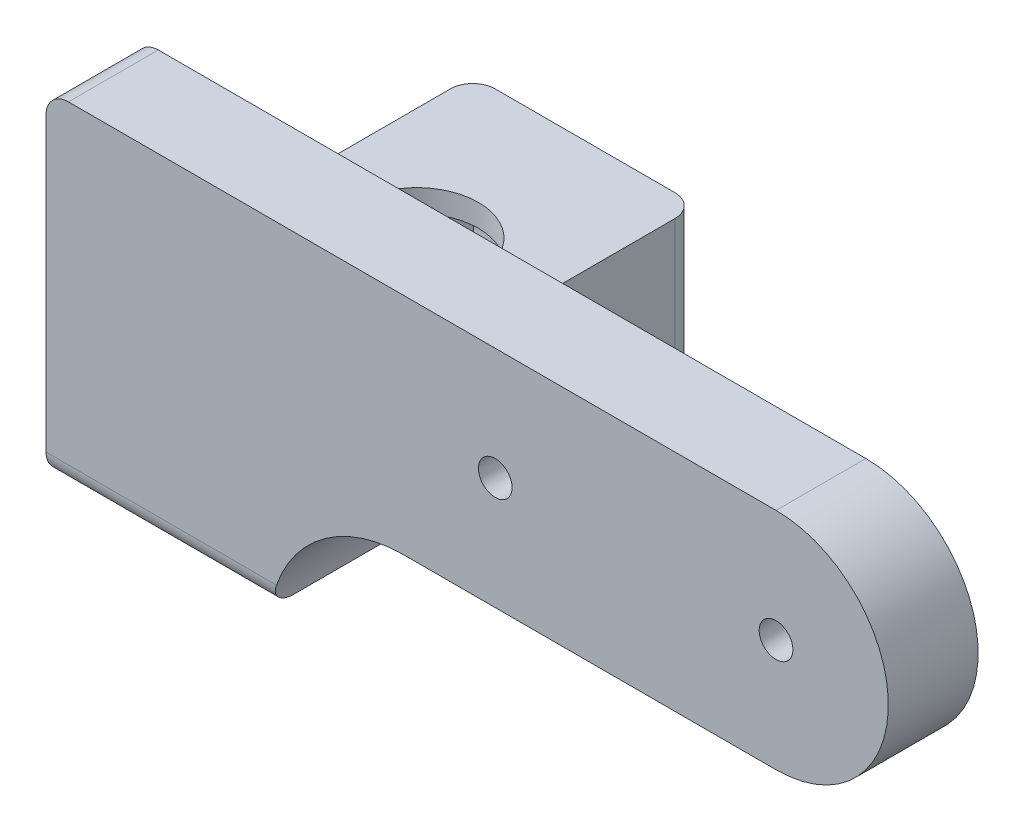
ISO-10303-21;
HEADER;
FILE_DESCRIPTION(('STEP AP214'),'2;1');
FILE_NAME('part.step','',(''),(''),'','','');
FILE_SCHEMA(('AUTOMOTIVE_DESIGN { 1 0 10303 214 1 1 1 1 }'));
ENDSEC;
DATA;
#1=APPLICATION_CONTEXT('core data for automotive mechanical design processes');
#2=APPLICATION_PROTOCOL_DEFINITION('international standard','automotive_design',2000,#1);
#3=PRODUCT_CONTEXT('',#1,'mechanical');
#4=PRODUCT('Part','Part','',(#3));
#5=PRODUCT_RELATED_PRODUCT_CATEGORY('part','',(#4));
#6=PRODUCT_DEFINITION_FORMATION('','',#4);
#7=PRODUCT_DEFINITION_CONTEXT('part definition',#1,'design');
#8=PRODUCT_DEFINITION('design','',#6,#7);
#9=PRODUCT_DEFINITION_SHAPE('','',#8);
#10=(LENGTH_UNIT() NAMED_UNIT(*) SI_UNIT(.MILLI.,.METRE.));
#11=(NAMED_UNIT(*) PLANE_ANGLE_UNIT() SI_UNIT($,.RADIAN.));
#12=(NAMED_UNIT(*) SI_UNIT($,.STERADIAN.) SOLID_ANGLE_UNIT());
#13=UNCERTAINTY_MEASURE_WITH_UNIT(LENGTH_MEASURE(1.E-05),#10,'distance_accuracy_value','');
#14=(GEOMETRIC_REPRESENTATION_CONTEXT(3) GLOBAL_UNCERTAINTY_ASSIGNED_CONTEXT((#13)) GLOBAL_UNIT_ASSIGNED_CONTEXT((#10,
#11,#12)) REPRESENTATION_CONTEXT('',''));
#15=CARTESIAN_POINT('',(0.,0.,0.));
#16=DIRECTION('',(0.,0.,1.));
#17=DIRECTION('',(1.,0.,0.));
#18=AXIS2_PLACEMENT_3D('',#15,#16,#17);
#19=CARTESIAN_POINT('',(40.,0.,0.));
#20=DIRECTION('',(0.,0.,1.));
#21=DIRECTION('',(1.,0.,0.));
#22=AXIS2_PLACEMENT_3D('',#19,#20,#21);
#23=PLANE('',#22);
#24=CARTESIAN_POINT('',(40.,0.,0.));
#25=DIRECTION('',(0.,0.,1.));
#26=DIRECTION('',(1.,0.,0.));
#27=AXIS2_PLACEMENT_3D('',#24,#25,#26);
#28=CIRCLE('',#27,1.5);
#29=CARTESIAN_POINT('',(41.5,0.,0.));
#30=VERTEX_POINT('',#29);
#31=EDGE_CURVE('E256',#30,#30,#28,.T.);
#32=ORIENTED_EDGE('',*,*,#31,.T.);
#33=EDGE_LOOP('',(#32));
#34=FACE_BOUND('',#33,.T.);
#35=CARTESIAN_POINT('',(15.,0.,0.));
#36=DIRECTION('',(0.,0.,-1.));
#37=DIRECTION('',(-1.,0.,0.));
#38=AXIS2_PLACEMENT_3D('',#35,#36,#37);
#39=CIRCLE('',#38,1.5);
#40=CARTESIAN_POINT('',(13.5,0.,0.));
#41=VERTEX_POINT('',#40);
#42=EDGE_CURVE('E245',#41,#41,#39,.T.);
#43=ORIENTED_EDGE('',*,*,#42,.F.);
#44=EDGE_LOOP('',(#43));
#45=FACE_BOUND('',#44,.T.);
#46=DIRECTION('',(0.,-1.,0.));
#47=VECTOR('',#46,1.);
#48=CARTESIAN_POINT('',(-25.,10.,0.));
#49=LINE('',#48,#47);
#50=CARTESIAN_POINT('',(-25.,8.,0.));
#51=VERTEX_POINT('',#50);
#52=CARTESIAN_POINT('',(-25.,-3.,0.));
#53=VERTEX_POINT('',#52);
#54=EDGE_CURVE('E269',#51,#53,#49,.T.);
#55=ORIENTED_EDGE('',*,*,#54,.F.);
#56=CARTESIAN_POINT('',(-23.,8.,0.));
#57=DIRECTION('',(0.,0.,1.));
#58=DIRECTION('',(1.,0.,0.));
#59=AXIS2_PLACEMENT_3D('',#56,#57,#58);
#60=CIRCLE('',#59,2.);
#61=CARTESIAN_POINT('',(-23.,10.,0.));
#62=VERTEX_POINT('',#61);
#63=EDGE_CURVE('E341',#51,#62,#60,.F.);
#64=ORIENTED_EDGE('',*,*,#63,.T.);
#65=DIRECTION('',(-1.,0.,0.));
#66=VECTOR('',#65,1.);
#67=CARTESIAN_POINT('',(-25.,10.,0.));
#68=LINE('',#67,#66);
#69=CARTESIAN_POINT('',(40.,10.,0.));
#70=VERTEX_POINT('',#69);
#71=EDGE_CURVE('E261',#70,#62,#68,.T.);
#72=ORIENTED_EDGE('',*,*,#71,.F.);
#73=CARTESIAN_POINT('',(40.,0.,0.));
#74=DIRECTION('',(0.,0.,1.));
#75=DIRECTION('',(1.,0.,0.));
#76=AXIS2_PLACEMENT_3D('',#73,#74,#75);
#77=CIRCLE('',#76,10.);
#78=CARTESIAN_POINT('',(40.,-10.,0.));
#79=VERTEX_POINT('',#78);
#80=EDGE_CURVE('E273',#79,#70,#77,.T.);
#81=ORIENTED_EDGE('',*,*,#80,.F.);
#82=DIRECTION('',(1.,0.,0.));
#83=VECTOR('',#82,1.);
#84=CARTESIAN_POINT('',(-25.,-10.,0.));
#85=LINE('',#84,#83);
#86=CARTESIAN_POINT('',(6.83215956619923,-10.,0.));
#87=VERTEX_POINT('',#86);
#88=EDGE_CURVE('E271',#87,#79,#85,.T.);
#89=ORIENTED_EDGE('',*,*,#88,.F.);
#90=CARTESIAN_POINT('',(6.83215956619924,-22.,0.));
#91=DIRECTION('',(0.,0.,1.));
#92=DIRECTION('',(1.,0.,0.));
#93=AXIS2_PLACEMENT_3D('',#90,#91,#92);
#94=CIRCLE('',#93,12.);
#95=CARTESIAN_POINT('',(0.,-12.1348291620473,0.));
#96=VERTEX_POINT('',#95);
#97=EDGE_CURVE('E287',#87,#96,#94,.T.);
#98=ORIENTED_EDGE('',*,*,#97,.T.);
#99=DIRECTION('',(0.,-1.,0.));
#100=VECTOR('',#99,1.);
#101=CARTESIAN_POINT('',(0.,0.,0.));
#102=LINE('',#101,#100);
#103=CARTESIAN_POINT('',(0.,-3.,0.));
#104=VERTEX_POINT('',#103);
#105=EDGE_CURVE('E300',#96,#104,#102,.F.);
#106=ORIENTED_EDGE('',*,*,#105,.T.);
#107=DIRECTION('',(1.,0.,0.));
#108=VECTOR('',#107,1.);
#109=CARTESIAN_POINT('',(-25.,-3.,0.));
#110=LINE('',#109,#108);
#111=EDGE_CURVE('E297',#104,#53,#110,.F.);
#112=ORIENTED_EDGE('',*,*,#111,.T.);
#113=EDGE_LOOP('',(#55,#64,#72,#81,#89,#98,#106,#112));
#114=FACE_BOUND('',#113,.T.);
#115=ADVANCED_FACE('F32',(#34,#45,#114),#23,.F.);
#116=CARTESIAN_POINT('',(-25.,10.,8.));
#117=DIRECTION('',(1.,0.,0.));
#118=DIRECTION('',(0.,1.,0.));
#119=AXIS2_PLACEMENT_3D('',#116,#117,#118);
#120=PLANE('',#119);
#121=DIRECTION('',(0.,0.,-1.));
#122=VECTOR('',#121,1.);
#123=CARTESIAN_POINT('',(-25.,-20.,8.));
#124=LINE('',#123,#122);
#125=CARTESIAN_POINT('',(-25.,-20.,6.));
#126=VERTEX_POINT('',#125);
#127=CARTESIAN_POINT('',(-25.,-20.,-28.));
#128=VERTEX_POINT('',#127);
#129=EDGE_CURVE('E242',#126,#128,#124,.T.);
#130=ORIENTED_EDGE('',*,*,#129,.F.);
#131=CARTESIAN_POINT('',(-25.,-18.,6.));
#132=DIRECTION('',(1.,0.,0.));
#133=DIRECTION('',(0.,1.,0.));
#134=AXIS2_PLACEMENT_3D('',#131,#132,#133);
#135=CIRCLE('',#134,2.);
#136=CARTESIAN_POINT('',(-25.,-18.,8.));
#137=VERTEX_POINT('',#136);
#138=EDGE_CURVE('E369',#126,#137,#135,.F.);
#139=ORIENTED_EDGE('',*,*,#138,.T.);
#140=DIRECTION('',(0.,-1.,0.));
#141=VECTOR('',#140,1.);
#142=CARTESIAN_POINT('',(-25.,10.,8.));
#143=LINE('',#142,#141);
#144=CARTESIAN_POINT('',(-25.,8.,8.));
#145=VERTEX_POINT('',#144);
#146=EDGE_CURVE('E257',#145,#137,#143,.T.);
#147=ORIENTED_EDGE('',*,*,#146,.F.);
#148=DIRECTION('',(0.,0.,-1.));
#149=VECTOR('',#148,1.);
#150=CARTESIAN_POINT('',(-25.,8.,8.));
#151=LINE('',#150,#149);
#152=EDGE_CURVE('E365',#145,#51,#151,.T.);
#153=ORIENTED_EDGE('',*,*,#152,.T.);
#154=ORIENTED_EDGE('',*,*,#54,.T.);
#155=CARTESIAN_POINT('',(-25.,-3.,-5.));
#156=DIRECTION('',(1.,0.,0.));
#157=DIRECTION('',(0.,1.,0.));
#158=AXIS2_PLACEMENT_3D('',#155,#156,#157);
#159=CIRCLE('',#158,5.);
#160=CARTESIAN_POINT('',(-25.,-8.,-5.));
#161=VERTEX_POINT('',#160);
#162=EDGE_CURVE('E312',#53,#161,#159,.T.);
#163=ORIENTED_EDGE('',*,*,#162,.T.);
#164=DIRECTION('',(0.,0.,1.));
#165=VECTOR('',#164,1.);
#166=CARTESIAN_POINT('',(-25.,-8.,-30.));
#167=LINE('',#166,#165);
#168=CARTESIAN_POINT('',(-25.,-8.,-28.));
#169=VERTEX_POINT('',#168);
#170=EDGE_CURVE('E236',#169,#161,#167,.T.);
#171=ORIENTED_EDGE('',*,*,#170,.F.);
#172=DIRECTION('',(0.,1.,0.));
#173=VECTOR('',#172,1.);
#174=CARTESIAN_POINT('',(-25.,10.,-28.));
#175=LINE('',#174,#173);
#176=EDGE_CURVE('E360',#169,#128,#175,.F.);
#177=ORIENTED_EDGE('',*,*,#176,.T.);
#178=EDGE_LOOP('',(#130,#139,#147,#153,#154,#163,#171,#177));
#179=FACE_BOUND('',#178,.T.);
#180=ADVANCED_FACE('F359',(#179),#120,.F.);
#181=CARTESIAN_POINT('',(-25.,-10.,8.));
#182=DIRECTION('',(0.,1.,0.));
#183=DIRECTION('',(0.,0.,1.));
#184=AXIS2_PLACEMENT_3D('',#181,#182,#183);
#185=PLANE('',#184);
#186=DIRECTION('',(1.,0.,0.));
#187=VECTOR('',#186,1.);
#188=CARTESIAN_POINT('',(-25.,-10.,8.));
#189=LINE('',#188,#187);
#190=CARTESIAN_POINT('',(6.83215956619923,-10.,8.));
#191=VERTEX_POINT('',#190);
#192=CARTESIAN_POINT('',(40.,-10.,8.));
#193=VERTEX_POINT('',#192);
#194=EDGE_CURVE('E260',#191,#193,#189,.T.);
#195=ORIENTED_EDGE('',*,*,#194,.F.);
#196=DIRECTION('',(0.,0.,-1.));
#197=VECTOR('',#196,1.);
#198=CARTESIAN_POINT('',(6.83215956619923,-10.,8.));
#199=LINE('',#198,#197);
#200=EDGE_CURVE('E282',#191,#87,#199,.T.);
#201=ORIENTED_EDGE('',*,*,#200,.T.);
#202=ORIENTED_EDGE('',*,*,#88,.T.);
#203=DIRECTION('',(0.,0.,-1.));
#204=VECTOR('',#203,1.);
#205=CARTESIAN_POINT('',(40.,-10.,8.));
#206=LINE('',#205,#204);
#207=EDGE_CURVE('E279',#193,#79,#206,.T.);
#208=ORIENTED_EDGE('',*,*,#207,.F.);
#209=EDGE_LOOP('',(#195,#201,#202,#208));
#210=FACE_BOUND('',#209,.T.);
#211=ADVANCED_FACE('F410',(#210),#185,.F.);
#212=CARTESIAN_POINT('',(40.,0.,8.));
#213=DIRECTION('',(0.,0.,-1.));
#214=DIRECTION('',(-1.,0.,0.));
#215=AXIS2_PLACEMENT_3D('',#212,#213,#214);
#216=CYLINDRICAL_SURFACE('',#215,10.);
#217=ORIENTED_EDGE('',*,*,#80,.T.);
#218=DIRECTION('',(0.,0.,-1.));
#219=VECTOR('',#218,1.);
#220=CARTESIAN_POINT('',(40.,10.,8.));
#221=LINE('',#220,#219);
#222=CARTESIAN_POINT('',(40.,10.,8.));
#223=VERTEX_POINT('',#222);
#224=EDGE_CURVE('E268',#223,#70,#221,.T.);
#225=ORIENTED_EDGE('',*,*,#224,.F.);
#226=CARTESIAN_POINT('',(40.,0.,8.));
#227=DIRECTION('',(0.,0.,1.));
#228=DIRECTION('',(1.,0.,0.));
#229=AXIS2_PLACEMENT_3D('',#226,#227,#228);
#230=CIRCLE('',#229,10.);
#231=EDGE_CURVE('E263',#193,#223,#230,.T.);
#232=ORIENTED_EDGE('',*,*,#231,.F.);
#233=ORIENTED_EDGE('',*,*,#207,.T.);
#234=EDGE_LOOP('',(#217,#225,#232,#233));
#235=FACE_BOUND('',#234,.T.);
#236=ADVANCED_FACE('F405',(#235),#216,.T.);
#237=CARTESIAN_POINT('',(-25.,10.,8.));
#238=DIRECTION('',(0.,-1.,0.));
#239=DIRECTION('',(0.,0.,-1.));
#240=AXIS2_PLACEMENT_3D('',#237,#238,#239);
#241=PLANE('',#240);
#242=ORIENTED_EDGE('',*,*,#71,.T.);
#243=DIRECTION('',(0.,0.,-1.));
#244=VECTOR('',#243,1.);
#245=CARTESIAN_POINT('',(-23.,10.,8.));
#246=LINE('',#245,#244);
#247=CARTESIAN_POINT('',(-23.,10.,8.));
#248=VERTEX_POINT('',#247);
#249=EDGE_CURVE('E345',#62,#248,#246,.F.);
#250=ORIENTED_EDGE('',*,*,#249,.T.);
#251=DIRECTION('',(-1.,0.,0.));
#252=VECTOR('',#251,1.);
#253=CARTESIAN_POINT('',(-25.,10.,8.));
#254=LINE('',#253,#252);
#255=EDGE_CURVE('E265',#223,#248,#254,.T.);
#256=ORIENTED_EDGE('',*,*,#255,.F.);
#257=ORIENTED_EDGE('',*,*,#224,.T.);
#258=EDGE_LOOP('',(#242,#250,#256,#257));
#259=FACE_BOUND('',#258,.T.);
#260=ADVANCED_FACE('F400',(#259),#241,.F.);
#261=CARTESIAN_POINT('',(40.,0.,8.));
#262=DIRECTION('',(0.,0.,1.));
#263=DIRECTION('',(1.,0.,0.));
#264=AXIS2_PLACEMENT_3D('',#261,#262,#263);
#265=PLANE('',#264);
#266=CARTESIAN_POINT('',(15.,0.,8.));
#267=DIRECTION('',(0.,0.,1.));
#268=DIRECTION('',(1.,0.,0.));
#269=AXIS2_PLACEMENT_3D('',#266,#267,#268);
#270=CIRCLE('',#269,1.5);
#271=CARTESIAN_POINT('',(16.5,0.,8.));
#272=VERTEX_POINT('',#271);
#273=EDGE_CURVE('E250',#272,#272,#270,.T.);
#274=ORIENTED_EDGE('',*,*,#273,.F.);
#275=EDGE_LOOP('',(#274));
#276=FACE_BOUND('',#275,.T.);
#277=CARTESIAN_POINT('',(40.,0.,8.));
#278=DIRECTION('',(0.,0.,1.));
#279=DIRECTION('',(1.,0.,0.));
#280=AXIS2_PLACEMENT_3D('',#277,#278,#279);
#281=CIRCLE('',#280,1.5);
#282=CARTESIAN_POINT('',(41.5,0.,8.));
#283=VERTEX_POINT('',#282);
#284=EDGE_CURVE('E253',#283,#283,#281,.T.);
#285=ORIENTED_EDGE('',*,*,#284,.F.);
#286=EDGE_LOOP('',(#285));
#287=FACE_BOUND('',#286,.T.);
#288=ORIENTED_EDGE('',*,*,#146,.T.);
#289=DIRECTION('',(-1.,0.,0.));
#290=VECTOR('',#289,1.);
#291=CARTESIAN_POINT('',(40.,-18.,8.));
#292=LINE('',#291,#290);
#293=CARTESIAN_POINT('',(-4.48154893278553,-18.,8.));
#294=VERTEX_POINT('',#293);
#295=EDGE_CURVE('E342',#137,#294,#292,.F.);
#296=ORIENTED_EDGE('',*,*,#295,.T.);
#297=CARTESIAN_POINT('',(6.83215956619924,-22.,8.));
#298=DIRECTION('',(0.,0.,1.));
#299=DIRECTION('',(1.,0.,0.));
#300=AXIS2_PLACEMENT_3D('',#297,#298,#299);
#301=CIRCLE('',#300,12.);
#302=EDGE_CURVE('E290',#294,#191,#301,.F.);
#303=ORIENTED_EDGE('',*,*,#302,.T.);
#304=ORIENTED_EDGE('',*,*,#194,.T.);
#305=ORIENTED_EDGE('',*,*,#231,.T.);
#306=ORIENTED_EDGE('',*,*,#255,.T.);
#307=CARTESIAN_POINT('',(-23.,8.,8.));
#308=DIRECTION('',(0.,0.,1.));
#309=DIRECTION('',(1.,0.,0.));
#310=AXIS2_PLACEMENT_3D('',#307,#308,#309);
#311=CIRCLE('',#310,2.);
#312=EDGE_CURVE('E376',#248,#145,#311,.T.);
#313=ORIENTED_EDGE('',*,*,#312,.T.);
#314=EDGE_LOOP('',(#288,#296,#303,#304,#305,#306,#313));
#315=FACE_BOUND('',#314,.T.);
#316=ADVANCED_FACE('F382',(#276,#287,#315),#265,.T.);
#317=CARTESIAN_POINT('',(40.,0.,-2.));
#318=DIRECTION('',(0.,0.,1.));
#319=DIRECTION('',(1.,0.,0.));
#320=AXIS2_PLACEMENT_3D('',#317,#318,#319);
#321=CYLINDRICAL_SURFACE('',#320,1.5);
#322=ORIENTED_EDGE('',*,*,#284,.T.);
#323=EDGE_LOOP('',(#322));
#324=FACE_BOUND('',#323,.T.);
#325=ORIENTED_EDGE('',*,*,#31,.F.);
#326=EDGE_LOOP('',(#325));
#327=FACE_BOUND('',#326,.T.);
#328=ADVANCED_FACE('F431',(#324,#327),#321,.F.);
#329=CARTESIAN_POINT('',(15.,0.,10.));
#330=DIRECTION('',(0.,0.,-1.));
#331=DIRECTION('',(-1.,0.,0.));
#332=AXIS2_PLACEMENT_3D('',#329,#330,#331);
#333=CYLINDRICAL_SURFACE('',#332,1.5);
#334=ORIENTED_EDGE('',*,*,#273,.T.);
#335=EDGE_LOOP('',(#334));
#336=FACE_BOUND('',#335,.T.);
#337=ORIENTED_EDGE('',*,*,#42,.T.);
#338=EDGE_LOOP('',(#337));
#339=FACE_BOUND('',#338,.T.);
#340=ADVANCED_FACE('F436',(#336,#339),#333,.F.);
#341=CARTESIAN_POINT('',(-25.,-20.,8.));
#342=DIRECTION('',(0.,-1.,0.));
#343=DIRECTION('',(1.,0.,0.));
#344=AXIS2_PLACEMENT_3D('',#341,#342,#343);
#345=PLANE('',#344);
#346=DIRECTION('',(-0.642787609686542,0.,0.766044443118976));
#347=VECTOR('',#346,1.);
#348=CARTESIAN_POINT('',(-6.62913409939624,-20.,-13.5239904898311));
#349=LINE('',#348,#347);
#350=CARTESIAN_POINT('',(-6.62913409939624,-20.,-13.5239904898311));
#351=VERTEX_POINT('',#350);
#352=CARTESIAN_POINT('',(-12.0928287817318,-20.,-7.01261272331977));
#353=VERTEX_POINT('',#352);
#354=EDGE_CURVE('E177',#351,#353,#349,.T.);
#355=ORIENTED_EDGE('',*,*,#354,.F.);
#356=DIRECTION('',(0.342020143325665,0.,0.93969262078591));
#357=VECTOR('',#356,1.);
#358=CARTESIAN_POINT('',(-9.5363053176644,-20.,-21.5113777665113));
#359=LINE('',#358,#357);
#360=CARTESIAN_POINT('',(-9.5363053176644,-20.,-21.5113777665113));
#361=VERTEX_POINT('',#360);
#362=EDGE_CURVE('E195',#361,#351,#359,.T.);
#363=ORIENTED_EDGE('',*,*,#362,.F.);
#364=DIRECTION('',(0.984807753012208,0.,0.173648177666933));
#365=VECTOR('',#364,1.);
#366=CARTESIAN_POINT('',(-17.9071712182682,-20.,-22.9873872766802));
#367=LINE('',#366,#365);
#368=CARTESIAN_POINT('',(-17.9071712182682,-20.,-22.9873872766802));
#369=VERTEX_POINT('',#368);
#370=EDGE_CURVE('E198',#369,#361,#367,.T.);
#371=ORIENTED_EDGE('',*,*,#370,.F.);
#372=DIRECTION('',(0.642787609686542,0.,-0.766044443118976));
#373=VECTOR('',#372,1.);
#374=CARTESIAN_POINT('',(-23.3708659006038,-20.,-16.4760095101689));
#375=LINE('',#374,#373);
#376=CARTESIAN_POINT('',(-23.3708659006038,-20.,-16.4760095101689));
#377=VERTEX_POINT('',#376);
#378=EDGE_CURVE('E217',#377,#369,#375,.T.);
#379=ORIENTED_EDGE('',*,*,#378,.F.);
#380=DIRECTION('',(-0.342020143325665,0.,-0.939692620785909));
#381=VECTOR('',#380,1.);
#382=CARTESIAN_POINT('',(-20.4636946823356,-20.,-8.4886222334887));
#383=LINE('',#382,#381);
#384=CARTESIAN_POINT('',(-20.4636946823356,-20.,-8.4886222334887));
#385=VERTEX_POINT('',#384);
#386=EDGE_CURVE('E214',#385,#377,#383,.T.);
#387=ORIENTED_EDGE('',*,*,#386,.F.);
#388=DIRECTION('',(-0.984807753012207,0.,-0.173648177666934));
#389=VECTOR('',#388,1.);
#390=CARTESIAN_POINT('',(-12.0928287817318,-20.,-7.01261272331977));
#391=LINE('',#390,#389);
#392=EDGE_CURVE('E211',#353,#385,#391,.T.);
#393=ORIENTED_EDGE('',*,*,#392,.F.);
#394=EDGE_LOOP('',(#355,#363,#371,#379,#387,#393));
#395=FACE_BOUND('',#394,.T.);
#396=DIRECTION('',(0.,0.,-1.));
#397=VECTOR('',#396,1.);
#398=CARTESIAN_POINT('',(-5.,-20.,8.));
#399=LINE('',#398,#397);
#400=CARTESIAN_POINT('',(-5.,-20.,6.));
#401=VERTEX_POINT('',#400);
#402=CARTESIAN_POINT('',(-5.,-20.,-5.));
#403=VERTEX_POINT('',#402);
#404=EDGE_CURVE('E246',#401,#403,#399,.T.);
#405=ORIENTED_EDGE('',*,*,#404,.F.);
#406=DIRECTION('',(-1.,0.,0.));
#407=VECTOR('',#406,1.);
#408=CARTESIAN_POINT('',(-25.,-20.,6.));
#409=LINE('',#408,#407);
#410=EDGE_CURVE('E366',#401,#126,#409,.T.);
#411=ORIENTED_EDGE('',*,*,#410,.T.);
#412=ORIENTED_EDGE('',*,*,#129,.T.);
#413=CARTESIAN_POINT('',(-23.,-20.,-28.));
#414=DIRECTION('',(0.,-1.,0.));
#415=DIRECTION('',(1.,0.,0.));
#416=AXIS2_PLACEMENT_3D('',#413,#414,#415);
#417=CIRCLE('',#416,2.);
#418=CARTESIAN_POINT('',(-23.,-20.,-30.));
#419=VERTEX_POINT('',#418);
#420=EDGE_CURVE('E364',#128,#419,#417,.T.);
#421=ORIENTED_EDGE('',*,*,#420,.T.);
#422=DIRECTION('',(-1.,0.,0.));
#423=VECTOR('',#422,1.);
#424=CARTESIAN_POINT('',(-25.,-20.,-30.));
#425=LINE('',#424,#423);
#426=CARTESIAN_POINT('',(-7.,-20.,-30.));
#427=VERTEX_POINT('',#426);
#428=EDGE_CURVE('E238',#427,#419,#425,.T.);
#429=ORIENTED_EDGE('',*,*,#428,.F.);
#430=CARTESIAN_POINT('',(-7.,-20.,-28.));
#431=DIRECTION('',(0.,-1.,0.));
#432=DIRECTION('',(1.,0.,0.));
#433=AXIS2_PLACEMENT_3D('',#430,#431,#432);
#434=CIRCLE('',#433,2.);
#435=CARTESIAN_POINT('',(-5.,-20.,-28.));
#436=VERTEX_POINT('',#435);
#437=EDGE_CURVE('E372',#427,#436,#434,.T.);
#438=ORIENTED_EDGE('',*,*,#437,.T.);
#439=EDGE_CURVE('E241',#403,#436,#399,.T.);
#440=ORIENTED_EDGE('',*,*,#439,.F.);
#441=EDGE_LOOP('',(#405,#411,#412,#421,#429,#438,#440));
#442=FACE_BOUND('',#441,.T.);
#443=ADVANCED_FACE('F390',(#395,#442),#345,.T.);
#444=CARTESIAN_POINT('',(-5.,-10.,8.));
#445=DIRECTION('',(1.,0.,0.));
#446=DIRECTION('',(0.,0.,-1.));
#447=AXIS2_PLACEMENT_3D('',#444,#445,#446);
#448=PLANE('',#447);
#449=ORIENTED_EDGE('',*,*,#439,.T.);
#450=DIRECTION('',(0.,-1.,0.));
#451=VECTOR('',#450,1.);
#452=CARTESIAN_POINT('',(-5.,-8.,-28.));
#453=LINE('',#452,#451);
#454=CARTESIAN_POINT('',(-5.,-8.,-28.));
#455=VERTEX_POINT('',#454);
#456=EDGE_CURVE('E47',#436,#455,#453,.F.);
#457=ORIENTED_EDGE('',*,*,#456,.T.);
#458=DIRECTION('',(0.,0.,-1.));
#459=VECTOR('',#458,1.);
#460=CARTESIAN_POINT('',(-5.,-8.,-30.));
#461=LINE('',#460,#459);
#462=CARTESIAN_POINT('',(-5.,-8.,-5.));
#463=VERTEX_POINT('',#462);
#464=EDGE_CURVE('E224',#463,#455,#461,.T.);
#465=ORIENTED_EDGE('',*,*,#464,.F.);
#466=DIRECTION('',(0.,-1.,0.));
#467=VECTOR('',#466,1.);
#468=CARTESIAN_POINT('',(-5.,-10.,-5.));
#469=LINE('',#468,#467);
#470=EDGE_CURVE('E292',#463,#403,#469,.T.);
#471=ORIENTED_EDGE('',*,*,#470,.T.);
#472=EDGE_LOOP('',(#449,#457,#465,#471));
#473=FACE_BOUND('',#472,.T.);
#474=ADVANCED_FACE('F451',(#473),#448,.T.);
#475=CARTESIAN_POINT('',(0.,0.,-30.));
#476=DIRECTION('',(0.,0.,1.));
#477=DIRECTION('',(1.,0.,0.));
#478=AXIS2_PLACEMENT_3D('',#475,#476,#477);
#479=PLANE('',#478);
#480=DIRECTION('',(-1.,0.,0.));
#481=VECTOR('',#480,1.);
#482=CARTESIAN_POINT('',(-5.,-8.,-30.));
#483=LINE('',#482,#481);
#484=CARTESIAN_POINT('',(-7.,-8.,-30.));
#485=VERTEX_POINT('',#484);
#486=CARTESIAN_POINT('',(-23.,-8.,-30.));
#487=VERTEX_POINT('',#486);
#488=EDGE_CURVE('E233',#485,#487,#483,.T.);
#489=ORIENTED_EDGE('',*,*,#488,.F.);
#490=DIRECTION('',(0.,-1.,0.));
#491=VECTOR('',#490,1.);
#492=CARTESIAN_POINT('',(-7.,-20.,-30.));
#493=LINE('',#492,#491);
#494=EDGE_CURVE('E349',#485,#427,#493,.T.);
#495=ORIENTED_EDGE('',*,*,#494,.T.);
#496=ORIENTED_EDGE('',*,*,#428,.T.);
#497=DIRECTION('',(0.,1.,0.));
#498=VECTOR('',#497,1.);
#499=CARTESIAN_POINT('',(-23.,0.,-30.));
#500=LINE('',#499,#498);
#501=EDGE_CURVE('E347',#419,#487,#500,.T.);
#502=ORIENTED_EDGE('',*,*,#501,.T.);
#503=EDGE_LOOP('',(#489,#495,#496,#502));
#504=FACE_BOUND('',#503,.T.);
#505=ADVANCED_FACE('F456',(#504),#479,.F.);
#506=CARTESIAN_POINT('',(6.83215956619924,-22.,8.));
#507=DIRECTION('',(0.,0.,-1.));
#508=DIRECTION('',(-1.,0.,0.));
#509=AXIS2_PLACEMENT_3D('',#506,#507,#508);
#510=CYLINDRICAL_SURFACE('',#509,12.);
#511=ORIENTED_EDGE('',*,*,#302,.F.);
#512=CARTESIAN_POINT('',(-4.48154893278553,-18.,8.));
#513=CARTESIAN_POINT('',(-4.50138125313948,-18.0560877717623,7.99999832305192));
#514=CARTESIAN_POINT('',(-4.52078424019849,-18.1123031979097,7.99763882394037));
#515=CARTESIAN_POINT('',(-4.55864154941412,-18.2246643135857,7.98814251719226));
#516=CARTESIAN_POINT('',(-4.57709563531679,-18.2808099823833,7.98100452596653));
#517=CARTESIAN_POINT('',(-4.63089238189496,-18.4486356009318,7.95232807713334));
#518=CARTESIAN_POINT('',(-4.66466130278686,-18.559680833343,7.92352709442766));
#519=CARTESIAN_POINT('',(-4.72735408814331,-18.7765785860345,7.84667328021879));
#520=CARTESIAN_POINT('',(-4.7562683096932,-18.8824204829235,7.79858276083968));
#521=CARTESIAN_POINT('',(-4.80888524868177,-19.0850345721453,7.68410594838005));
#522=CARTESIAN_POINT('',(-4.8325930659608,-19.1818155860983,7.61773770389394));
#523=CARTESIAN_POINT('',(-4.87405212171451,-19.3594265529934,7.47129257380848));
#524=CARTESIAN_POINT('',(-4.89199696991578,-19.4407259787916,7.39183921718088));
#525=CARTESIAN_POINT('',(-4.92339777930131,-19.5890591318635,7.21975075455985));
#526=CARTESIAN_POINT('',(-4.93685253648592,-19.6560890310796,7.12711212247243));
#527=CARTESIAN_POINT('',(-4.95935046191041,-19.772062493677,6.93390339662555));
#528=CARTESIAN_POINT('',(-4.96849692689365,-19.8214219011766,6.83359426728588));
#529=CARTESIAN_POINT('',(-4.98322858152512,-19.902781623108,6.62596324805298));
#530=CARTESIAN_POINT('',(-4.98881654519301,-19.9347954563216,6.51864689275829));
#531=CARTESIAN_POINT('',(-4.99519390458775,-19.9717226972868,6.34212747261345));
#532=CARTESIAN_POINT('',(-4.99700177862493,-19.9823210790566,6.27409656410973));
#533=CARTESIAN_POINT('',(-4.99940140648305,-19.9964577732676,6.13738714644132));
#534=CARTESIAN_POINT('',(-4.99999497922922,-20.0000066450736,6.06870976091195));
#535=CARTESIAN_POINT('',(-5.,-20.,6.));
#536=B_SPLINE_CURVE_WITH_KNOTS('',3,(#512,#513,#514,#515,#516,#517,#518,#519,#520,#521,#522,
#523,#524,#525,#526,#527,#528,#529,#530,#531,#532,#533,#534,#535),.UNSPECIFIED.,.F.,.F.,(4,2,2,
2,2,2,2,2,2,2,2,4),(0.,0.17837527524822,0.356794748790082,0.713707003854084,1.07132001712111,
1.42858115883977,1.7721376621222,2.11578621480146,2.45071320477386,2.78537878270886,
2.99165964856607,3.19763129543271),.UNSPECIFIED.);
#537=EDGE_CURVE('E334',#294,#401,#536,.T.);
#538=ORIENTED_EDGE('',*,*,#537,.T.);
#539=ORIENTED_EDGE('',*,*,#404,.T.);
#540=CARTESIAN_POINT('',(-5.,-20.,-5.));
#541=CARTESIAN_POINT('',(-5.00002983071516,-20.0002423652182,-4.94276954902935));
#542=CARTESIAN_POINT('',(-4.99901934267985,-19.9941907321539,-4.88595530761524));
#543=CARTESIAN_POINT('',(-4.99525039157633,-19.9720554020881,-4.77555185338585));
#544=CARTESIAN_POINT('',(-4.99252898286227,-19.9561844798837,-4.72192001648874));
#545=CARTESIAN_POINT('',(-4.98408791010207,-19.90785267169,-4.59418000961095));
#546=CARTESIAN_POINT('',(-4.97756841164664,-19.8711330466681,-4.52180614517529));
#547=CARTESIAN_POINT('',(-4.96223202410665,-19.7877219107002,-4.3825808930968));
#548=CARTESIAN_POINT('',(-4.95339017335325,-19.7409231136344,-4.31580059752893));
#549=CARTESIAN_POINT('',(-4.92774697062384,-19.6101574112571,-4.14638742167474));
#550=CARTESIAN_POINT('',(-4.90944657037671,-19.5213908358724,-4.04776496875074));
#551=CARTESIAN_POINT('',(-4.86890013634191,-19.336487127318,-3.85845009250445));
#552=CARTESIAN_POINT('',(-4.8466436889024,-19.2403309309494,-3.76777956580897));
#553=CARTESIAN_POINT('',(-4.79843003565541,-19.0437085450451,-3.59166124125073));
#554=CARTESIAN_POINT('',(-4.7724617061297,-18.9432300591574,-3.50623028658098));
#555=CARTESIAN_POINT('',(-4.71703917712112,-18.7400762924599,-3.33950703775577));
#556=CARTESIAN_POINT('',(-4.68758913168601,-18.6374037469055,-3.2582099738707));
#557=CARTESIAN_POINT('',(-4.61901325405676,-18.4100985902356,-3.08290445499588));
#558=CARTESIAN_POINT('',(-4.57912825037921,-18.2851624051574,-2.98958644310515));
#559=CARTESIAN_POINT('',(-4.49437716998494,-18.034255935153,-2.80666530000505));
#560=CARTESIAN_POINT('',(-4.44951033121737,-17.9082854947577,-2.71706274002012));
#561=CARTESIAN_POINT('',(-4.30730488015702,-17.5295368759611,-2.4530012696897));
#562=CARTESIAN_POINT('',(-4.2024203561827,-17.2761195498434,-2.28343795798222));
#563=CARTESIAN_POINT('',(-3.9722913836724,-16.7711556777164,-1.95686688191674));
#564=CARTESIAN_POINT('',(-3.84708080936692,-16.5196067351079,-1.79983886555038));
#565=CARTESIAN_POINT('',(-3.57558827900187,-16.0200735556958,-1.49911766184629));
#566=CARTESIAN_POINT('',(-3.4293185993765,-15.7720873339923,-1.35541678512763));
#567=CARTESIAN_POINT('',(-3.14961065204293,-15.335473435628,-1.11332897815827));
#568=CARTESIAN_POINT('',(-3.0204258322933,-15.1457864250495,-1.01192702679406));
#569=CARTESIAN_POINT('',(-2.7485294155333,-14.7706115192609,-0.819893533912961));
#570=CARTESIAN_POINT('',(-2.60581660491877,-14.5851240026428,-0.729262960349702));
#571=CARTESIAN_POINT('',(-2.30728539567637,-14.2201589955088,-0.560890363369335));
#572=CARTESIAN_POINT('',(-2.15151761366808,-14.0406617508639,-0.483101744511609));
#573=CARTESIAN_POINT('',(-1.82648848948985,-13.6882485401282,-0.342179324884258));
#574=CARTESIAN_POINT('',(-1.65723183331395,-13.5153303190805,-0.279040464390576));
#575=CARTESIAN_POINT('',(-1.36841508496078,-13.2378560430232,-0.189444479936658));
#576=CARTESIAN_POINT('',(-1.25267734182957,-13.1309270879083,-0.157938067629622));
#577=CARTESIAN_POINT('',(-1.01604778268768,-12.9208668537399,-0.102817284378438));
#578=CARTESIAN_POINT('',(-0.895157979504437,-12.8177341203861,-0.0791998626316512));
#579=CARTESIAN_POINT('',(-0.647824429568627,-12.6151449323776,-0.0405569345325324));
#580=CARTESIAN_POINT('',(-0.521353323286093,-12.5157123550073,-0.0255803859630951));
#581=CARTESIAN_POINT('',(-0.263900565394985,-12.32156759435,-0.00529847183239202));
#582=CARTESIAN_POINT('',(-0.132914578924757,-12.2268601740619,-2.6803381606355E-06));
#583=CARTESIAN_POINT('',(0.,-12.1348291620473,0.));
#584=B_SPLINE_CURVE_WITH_KNOTS('',3,(#540,#541,#542,#543,#544,#545,#546,#547,#548,#549,#550,
#551,#552,#553,#554,#555,#556,#557,#558,#559,#560,#561,#562,#563,#564,#565,#566,#567,#568,#569,
#570,#571,#572,#573,#574,#575,#576,#577,#578,#579,#580,#581,#582,#583),.UNSPECIFIED.,.F.,.F.,(4,
2,2,2,2,2,2,2,2,2,2,2,2,2,2,2,2,2,2,2,2,4),(0.,0.170703151596656,0.337830952092287,
0.580693490649767,0.826281587637511,1.22705914658555,1.62890774734898,2.03198688396057,
2.43458986869146,2.91732242315391,3.40012892122403,4.3665052326105,5.33128726545324,
6.29550913757507,7.04766010365497,7.79987860962329,8.54930476127781,9.29847169003779,
9.78026574132661,10.2618732586285,10.7461833470875,11.2309721495371),.UNSPECIFIED.);
#585=EDGE_CURVE('E304',#403,#96,#584,.T.);
#586=ORIENTED_EDGE('',*,*,#585,.T.);
#587=ORIENTED_EDGE('',*,*,#97,.F.);
#588=ORIENTED_EDGE('',*,*,#200,.F.);
#589=EDGE_LOOP('',(#511,#538,#539,#586,#587,#588));
#590=FACE_BOUND('',#589,.T.);
#591=ADVANCED_FACE('F314',(#590),#510,.F.);
#592=CARTESIAN_POINT('',(0.,-8.,0.));
#593=DIRECTION('',(0.,-1.,0.));
#594=DIRECTION('',(1.,0.,0.));
#595=AXIS2_PLACEMENT_3D('',#592,#593,#594);
#596=PLANE('',#595);
#597=CARTESIAN_POINT('',(-15.,-8.,-15.));
#598=DIRECTION('',(0.,-1.,0.));
#599=DIRECTION('',(1.,0.,0.));
#600=AXIS2_PLACEMENT_3D('',#597,#598,#599);
#601=CIRCLE('',#600,5.5);
#602=CARTESIAN_POINT('',(-9.5,-8.,-15.));
#603=VERTEX_POINT('',#602);
#604=EDGE_CURVE('E212',#603,#603,#601,.T.);
#605=ORIENTED_EDGE('',*,*,#604,.T.);
#606=EDGE_LOOP('',(#605));
#607=FACE_BOUND('',#606,.T.);
#608=ORIENTED_EDGE('',*,*,#464,.T.);
#609=CARTESIAN_POINT('',(-7.,-8.,-28.));
#610=DIRECTION('',(0.,-1.,0.));
#611=DIRECTION('',(1.,0.,0.));
#612=AXIS2_PLACEMENT_3D('',#609,#610,#611);
#613=CIRCLE('',#612,2.);
#614=EDGE_CURVE('E11',#455,#485,#613,.F.);
#615=ORIENTED_EDGE('',*,*,#614,.T.);
#616=ORIENTED_EDGE('',*,*,#488,.T.);
#617=CARTESIAN_POINT('',(-23.,-8.,-28.));
#618=DIRECTION('',(0.,-1.,0.));
#619=DIRECTION('',(1.,0.,0.));
#620=AXIS2_PLACEMENT_3D('',#617,#618,#619);
#621=CIRCLE('',#620,2.);
#622=EDGE_CURVE('E40',#487,#169,#621,.F.);
#623=ORIENTED_EDGE('',*,*,#622,.T.);
#624=ORIENTED_EDGE('',*,*,#170,.T.);
#625=DIRECTION('',(1.,0.,0.));
#626=VECTOR('',#625,1.);
#627=CARTESIAN_POINT('',(-5.,-8.,-5.));
#628=LINE('',#627,#626);
#629=EDGE_CURVE('E302',#161,#463,#628,.T.);
#630=ORIENTED_EDGE('',*,*,#629,.T.);
#631=EDGE_LOOP('',(#608,#615,#616,#623,#624,#630));
#632=FACE_BOUND('',#631,.T.);
#633=ADVANCED_FACE('F354',(#607,#632),#596,.F.);
#634=CARTESIAN_POINT('',(-6.62913409939624,-10.,-13.5239904898311));
#635=DIRECTION('',(0.766044443118976,0.,0.642787609686542));
#636=DIRECTION('',(0.642787609686542,0.,-0.766044443118976));
#637=AXIS2_PLACEMENT_3D('',#634,#635,#636);
#638=PLANE('',#637);
#639=ORIENTED_EDGE('',*,*,#354,.T.);
#640=DIRECTION('',(0.,-1.,0.));
#641=VECTOR('',#640,1.);
#642=CARTESIAN_POINT('',(-12.0928287817318,-10.,-7.01261272331977));
#643=LINE('',#642,#641);
#644=CARTESIAN_POINT('',(-12.0928287817318,-10.,-7.01261272331977));
#645=VERTEX_POINT('',#644);
#646=EDGE_CURVE('E170',#645,#353,#643,.T.);
#647=ORIENTED_EDGE('',*,*,#646,.F.);
#648=DIRECTION('',(-0.642787609686542,0.,0.766044443118976));
#649=VECTOR('',#648,1.);
#650=CARTESIAN_POINT('',(-6.62913409939624,-10.,-13.5239904898311));
#651=LINE('',#650,#649);
#652=CARTESIAN_POINT('',(-6.62913409939624,-10.,-13.5239904898311));
#653=VERTEX_POINT('',#652);
#654=EDGE_CURVE('E174',#653,#645,#651,.T.);
#655=ORIENTED_EDGE('',*,*,#654,.F.);
#656=DIRECTION('',(0.,-1.,0.));
#657=VECTOR('',#656,1.);
#658=CARTESIAN_POINT('',(-6.62913409939624,-10.,-13.5239904898311));
#659=LINE('',#658,#657);
#660=EDGE_CURVE('E222',#653,#351,#659,.T.);
#661=ORIENTED_EDGE('',*,*,#660,.T.);
#662=EDGE_LOOP('',(#639,#647,#655,#661));
#663=FACE_BOUND('',#662,.T.);
#664=ADVANCED_FACE('F172',(#663),#638,.F.);
#665=CARTESIAN_POINT('',(-9.53630531766439,-10.,-21.5113777665113));
#666=DIRECTION('',(0.93969262078591,0.,-0.342020143325665));
#667=DIRECTION('',(-0.342020143325665,0.,-0.93969262078591));
#668=AXIS2_PLACEMENT_3D('',#665,#666,#667);
#669=PLANE('',#668);
#670=ORIENTED_EDGE('',*,*,#362,.T.);
#671=ORIENTED_EDGE('',*,*,#660,.F.);
#672=DIRECTION('',(0.342020143325665,0.,0.93969262078591));
#673=VECTOR('',#672,1.);
#674=CARTESIAN_POINT('',(-9.53630531766439,-10.,-21.5113777665113));
#675=LINE('',#674,#673);
#676=CARTESIAN_POINT('',(-9.53630531766439,-10.,-21.5113777665113));
#677=VERTEX_POINT('',#676);
#678=EDGE_CURVE('E182',#677,#653,#675,.T.);
#679=ORIENTED_EDGE('',*,*,#678,.F.);
#680=DIRECTION('',(0.,-1.,0.));
#681=VECTOR('',#680,1.);
#682=CARTESIAN_POINT('',(-9.53630531766439,-10.,-21.5113777665113));
#683=LINE('',#682,#681);
#684=EDGE_CURVE('E225',#677,#361,#683,.T.);
#685=ORIENTED_EDGE('',*,*,#684,.T.);
#686=EDGE_LOOP('',(#670,#671,#679,#685));
#687=FACE_BOUND('',#686,.T.);
#688=ADVANCED_FACE('F466',(#687),#669,.F.);
#689=CARTESIAN_POINT('',(-17.9071712182682,-10.,-22.9873872766802));
#690=DIRECTION('',(0.173648177666933,0.,-0.984807753012208));
#691=DIRECTION('',(-0.984807753012208,0.,-0.173648177666933));
#692=AXIS2_PLACEMENT_3D('',#689,#690,#691);
#693=PLANE('',#692);
#694=ORIENTED_EDGE('',*,*,#370,.T.);
#695=ORIENTED_EDGE('',*,*,#684,.F.);
#696=DIRECTION('',(0.984807753012208,0.,0.173648177666933));
#697=VECTOR('',#696,1.);
#698=CARTESIAN_POINT('',(-17.9071712182682,-10.,-22.9873872766802));
#699=LINE('',#698,#697);
#700=CARTESIAN_POINT('',(-17.9071712182682,-10.,-22.9873872766802));
#701=VERTEX_POINT('',#700);
#702=EDGE_CURVE('E207',#701,#677,#699,.T.);
#703=ORIENTED_EDGE('',*,*,#702,.F.);
#704=DIRECTION('',(0.,-1.,0.));
#705=VECTOR('',#704,1.);
#706=CARTESIAN_POINT('',(-17.9071712182682,-10.,-22.9873872766802));
#707=LINE('',#706,#705);
#708=EDGE_CURVE('E227',#701,#369,#707,.T.);
#709=ORIENTED_EDGE('',*,*,#708,.T.);
#710=EDGE_LOOP('',(#694,#695,#703,#709));
#711=FACE_BOUND('',#710,.T.);
#712=ADVANCED_FACE('F476',(#711),#693,.F.);
#713=CARTESIAN_POINT('',(-23.3708659006038,-10.,-16.4760095101689));
#714=DIRECTION('',(-0.766044443118976,0.,-0.642787609686542));
#715=DIRECTION('',(-0.642787609686542,0.,0.766044443118976));
#716=AXIS2_PLACEMENT_3D('',#713,#714,#715);
#717=PLANE('',#716);
#718=ORIENTED_EDGE('',*,*,#378,.T.);
#719=ORIENTED_EDGE('',*,*,#708,.F.);
#720=DIRECTION('',(0.642787609686542,0.,-0.766044443118976));
#721=VECTOR('',#720,1.);
#722=CARTESIAN_POINT('',(-23.3708659006038,-10.,-16.4760095101689));
#723=LINE('',#722,#721);
#724=CARTESIAN_POINT('',(-23.3708659006038,-10.,-16.4760095101689));
#725=VERTEX_POINT('',#724);
#726=EDGE_CURVE('E204',#725,#701,#723,.T.);
#727=ORIENTED_EDGE('',*,*,#726,.F.);
#728=DIRECTION('',(0.,-1.,0.));
#729=VECTOR('',#728,1.);
#730=CARTESIAN_POINT('',(-23.3708659006038,-10.,-16.4760095101689));
#731=LINE('',#730,#729);
#732=EDGE_CURVE('E229',#725,#377,#731,.T.);
#733=ORIENTED_EDGE('',*,*,#732,.T.);
#734=EDGE_LOOP('',(#718,#719,#727,#733));
#735=FACE_BOUND('',#734,.T.);
#736=ADVANCED_FACE('F472',(#735),#717,.F.);
#737=CARTESIAN_POINT('',(-20.4636946823356,-10.,-8.4886222334887));
#738=DIRECTION('',(-0.93969262078591,0.,0.342020143325665));
#739=DIRECTION('',(0.342020143325665,0.,0.93969262078591));
#740=AXIS2_PLACEMENT_3D('',#737,#738,#739);
#741=PLANE('',#740);
#742=ORIENTED_EDGE('',*,*,#386,.T.);
#743=ORIENTED_EDGE('',*,*,#732,.F.);
#744=DIRECTION('',(-0.342020143325665,0.,-0.939692620785909));
#745=VECTOR('',#744,1.);
#746=CARTESIAN_POINT('',(-20.4636946823356,-10.,-8.4886222334887));
#747=LINE('',#746,#745);
#748=CARTESIAN_POINT('',(-20.4636946823356,-10.,-8.4886222334887));
#749=VERTEX_POINT('',#748);
#750=EDGE_CURVE('E190',#749,#725,#747,.T.);
#751=ORIENTED_EDGE('',*,*,#750,.F.);
#752=DIRECTION('',(0.,-1.,0.));
#753=VECTOR('',#752,1.);
#754=CARTESIAN_POINT('',(-20.4636946823356,-10.,-8.4886222334887));
#755=LINE('',#754,#753);
#756=EDGE_CURVE('E181',#749,#385,#755,.T.);
#757=ORIENTED_EDGE('',*,*,#756,.T.);
#758=EDGE_LOOP('',(#742,#743,#751,#757));
#759=FACE_BOUND('',#758,.T.);
#760=ADVANCED_FACE('F469',(#759),#741,.F.);
#761=CARTESIAN_POINT('',(-12.0928287817318,-10.,-7.01261272331977));
#762=DIRECTION('',(-0.173648177666934,0.,0.984807753012207));
#763=DIRECTION('',(0.984807753012207,0.,0.173648177666934));
#764=AXIS2_PLACEMENT_3D('',#761,#762,#763);
#765=PLANE('',#764);
#766=ORIENTED_EDGE('',*,*,#392,.T.);
#767=ORIENTED_EDGE('',*,*,#756,.F.);
#768=DIRECTION('',(-0.984807753012207,0.,-0.173648177666934));
#769=VECTOR('',#768,1.);
#770=CARTESIAN_POINT('',(-12.0928287817318,-10.,-7.01261272331977));
#771=LINE('',#770,#769);
#772=EDGE_CURVE('E185',#645,#749,#771,.T.);
#773=ORIENTED_EDGE('',*,*,#772,.F.);
#774=ORIENTED_EDGE('',*,*,#646,.T.);
#775=EDGE_LOOP('',(#766,#767,#773,#774));
#776=FACE_BOUND('',#775,.T.);
#777=ADVANCED_FACE('F186',(#776),#765,.F.);
#778=CARTESIAN_POINT('',(0.,-10.,0.));
#779=DIRECTION('',(0.,-1.,0.));
#780=DIRECTION('',(0.,0.,-1.));
#781=AXIS2_PLACEMENT_3D('',#778,#779,#780);
#782=PLANE('',#781);
#783=CARTESIAN_POINT('',(-15.,-10.,-15.));
#784=DIRECTION('',(0.,-1.,0.));
#785=DIRECTION('',(0.,0.,-1.));
#786=AXIS2_PLACEMENT_3D('',#783,#784,#785);
#787=CIRCLE('',#786,5.5);
#788=CARTESIAN_POINT('',(-15.,-10.,-20.5));
#789=VERTEX_POINT('',#788);
#790=EDGE_CURVE('E201',#789,#789,#787,.T.);
#791=ORIENTED_EDGE('',*,*,#790,.F.);
#792=EDGE_LOOP('',(#791));
#793=FACE_BOUND('',#792,.T.);
#794=ORIENTED_EDGE('',*,*,#654,.T.);
#795=ORIENTED_EDGE('',*,*,#772,.T.);
#796=ORIENTED_EDGE('',*,*,#750,.T.);
#797=ORIENTED_EDGE('',*,*,#726,.T.);
#798=ORIENTED_EDGE('',*,*,#702,.T.);
#799=ORIENTED_EDGE('',*,*,#678,.T.);
#800=EDGE_LOOP('',(#794,#795,#796,#797,#798,#799));
#801=FACE_BOUND('',#800,.T.);
#802=ADVANCED_FACE('F192',(#793,#801),#782,.T.);
#803=CARTESIAN_POINT('',(-15.,0.,-15.));
#804=DIRECTION('',(0.,-1.,0.));
#805=DIRECTION('',(0.,0.,-1.));
#806=AXIS2_PLACEMENT_3D('',#803,#804,#805);
#807=CYLINDRICAL_SURFACE('',#806,5.5);
#808=ORIENTED_EDGE('',*,*,#790,.T.);
#809=EDGE_LOOP('',(#808));
#810=FACE_BOUND('',#809,.T.);
#811=ORIENTED_EDGE('',*,*,#604,.F.);
#812=EDGE_LOOP('',(#811));
#813=FACE_BOUND('',#812,.T.);
#814=ADVANCED_FACE('F326',(#810,#813),#807,.F.);
#815=CARTESIAN_POINT('',(0.,-3.,-5.));
#816=DIRECTION('',(-1.,0.,0.));
#817=DIRECTION('',(0.,-1.,0.));
#818=AXIS2_PLACEMENT_3D('',#815,#816,#817);
#819=CYLINDRICAL_SURFACE('',#818,5.);
#820=ORIENTED_EDGE('',*,*,#162,.F.);
#821=ORIENTED_EDGE('',*,*,#111,.F.);
#822=CARTESIAN_POINT('',(0.,-3.,-5.));
#823=DIRECTION('',(-0.707106781186547,0.707106781186547,0.));
#824=DIRECTION('',(-0.707106781186548,-0.707106781186547,0.));
#825=AXIS2_PLACEMENT_3D('',#822,#823,#824);
#826=ELLIPSE('',#825,7.07106781186547,5.);
#827=EDGE_CURVE('E495',#463,#104,#826,.T.);
#828=ORIENTED_EDGE('',*,*,#827,.F.);
#829=ORIENTED_EDGE('',*,*,#629,.F.);
#830=EDGE_LOOP('',(#820,#821,#828,#829));
#831=FACE_BOUND('',#830,.T.);
#832=ADVANCED_FACE('F322',(#831),#819,.F.);
#833=CARTESIAN_POINT('',(0.,-10.,-5.));
#834=DIRECTION('',(0.,-1.,0.));
#835=DIRECTION('',(0.,0.,-1.));
#836=AXIS2_PLACEMENT_3D('',#833,#834,#835);
#837=CYLINDRICAL_SURFACE('',#836,5.);
#838=ORIENTED_EDGE('',*,*,#827,.T.);
#839=ORIENTED_EDGE('',*,*,#105,.F.);
#840=ORIENTED_EDGE('',*,*,#585,.F.);
#841=ORIENTED_EDGE('',*,*,#470,.F.);
#842=EDGE_LOOP('',(#838,#839,#840,#841));
#843=FACE_BOUND('',#842,.T.);
#844=ADVANCED_FACE('F317',(#843),#837,.F.);
#845=CARTESIAN_POINT('',(-25.,-18.,6.));
#846=DIRECTION('',(-1.,0.,0.));
#847=DIRECTION('',(0.,-1.,0.));
#848=AXIS2_PLACEMENT_3D('',#845,#846,#847);
#849=CYLINDRICAL_SURFACE('',#848,2.);
#850=ORIENTED_EDGE('',*,*,#537,.F.);
#851=ORIENTED_EDGE('',*,*,#295,.F.);
#852=ORIENTED_EDGE('',*,*,#138,.F.);
#853=ORIENTED_EDGE('',*,*,#410,.F.);
#854=EDGE_LOOP('',(#850,#851,#852,#853));
#855=FACE_BOUND('',#854,.T.);
#856=ADVANCED_FACE('F321',(#855),#849,.T.);
#857=CARTESIAN_POINT('',(-23.,8.,8.));
#858=DIRECTION('',(0.,0.,-1.));
#859=DIRECTION('',(-1.,0.,0.));
#860=AXIS2_PLACEMENT_3D('',#857,#858,#859);
#861=CYLINDRICAL_SURFACE('',#860,2.);
#862=ORIENTED_EDGE('',*,*,#312,.F.);
#863=ORIENTED_EDGE('',*,*,#249,.F.);
#864=ORIENTED_EDGE('',*,*,#63,.F.);
#865=ORIENTED_EDGE('',*,*,#152,.F.);
#866=EDGE_LOOP('',(#862,#863,#864,#865));
#867=FACE_BOUND('',#866,.T.);
#868=ADVANCED_FACE('F331',(#867),#861,.T.);
#869=CARTESIAN_POINT('',(-7.,0.,-28.));
#870=DIRECTION('',(0.,1.,0.));
#871=DIRECTION('',(0.,0.,1.));
#872=AXIS2_PLACEMENT_3D('',#869,#870,#871);
#873=CYLINDRICAL_SURFACE('',#872,2.);
#874=ORIENTED_EDGE('',*,*,#614,.F.);
#875=ORIENTED_EDGE('',*,*,#456,.F.);
#876=ORIENTED_EDGE('',*,*,#437,.F.);
#877=ORIENTED_EDGE('',*,*,#494,.F.);
#878=EDGE_LOOP('',(#874,#875,#876,#877));
#879=FACE_BOUND('',#878,.T.);
#880=ADVANCED_FACE('F504',(#879),#873,.T.);
#881=CARTESIAN_POINT('',(-23.,0.,-28.));
#882=DIRECTION('',(0.,1.,0.));
#883=DIRECTION('',(-1.,0.,0.));
#884=AXIS2_PLACEMENT_3D('',#881,#882,#883);
#885=CYLINDRICAL_SURFACE('',#884,2.);
#886=ORIENTED_EDGE('',*,*,#420,.F.);
#887=ORIENTED_EDGE('',*,*,#176,.F.);
#888=ORIENTED_EDGE('',*,*,#622,.F.);
#889=ORIENTED_EDGE('',*,*,#501,.F.);
#890=EDGE_LOOP('',(#886,#887,#888,#889));
#891=FACE_BOUND('',#890,.T.);
#892=ADVANCED_FACE('F34',(#891),#885,.T.);
#893=CLOSED_SHELL('',(#115,#180,#211,#236,#260,#316,#328,#340,#443,#474,#505,#591,#633,#664,
#688,#712,#736,#760,#777,#802,#814,#832,#844,#856,#868,#880,#892));
#894=MANIFOLD_SOLID_BREP('B2',#893);
#895=ADVANCED_BREP_SHAPE_REPRESENTATION('',(#18,#894),#14);
#896=SHAPE_DEFINITION_REPRESENTATION(#9,#895);
ENDSEC;
END-ISO-10303-21;
